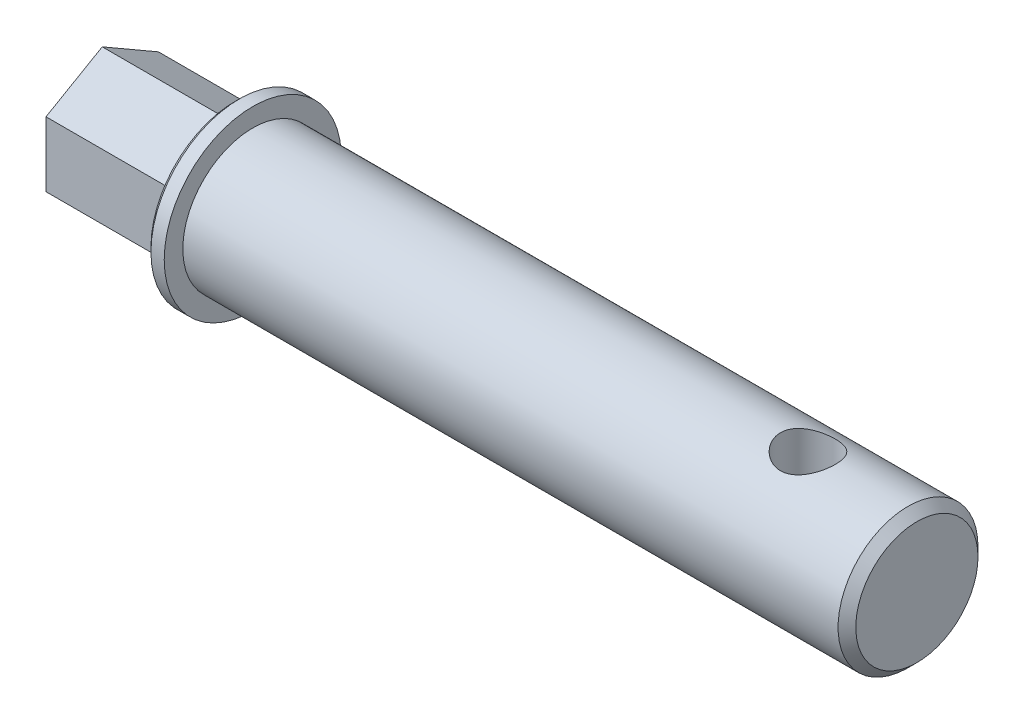
ISO-10303-21;
HEADER;
FILE_DESCRIPTION(('STEP AP214'),'2;1');
FILE_NAME('part.step','',(''),(''),'','','');
FILE_SCHEMA(('AUTOMOTIVE_DESIGN { 1 0 10303 214 1 1 1 1 }'));
ENDSEC;
DATA;
#1=APPLICATION_CONTEXT('core data for automotive mechanical design processes');
#2=APPLICATION_PROTOCOL_DEFINITION('international standard','automotive_design',2000,#1);
#3=PRODUCT_CONTEXT('',#1,'mechanical');
#4=PRODUCT('Part','Part','',(#3));
#5=PRODUCT_RELATED_PRODUCT_CATEGORY('part','',(#4));
#6=PRODUCT_DEFINITION_FORMATION('','',#4);
#7=PRODUCT_DEFINITION_CONTEXT('part definition',#1,'design');
#8=PRODUCT_DEFINITION('design','',#6,#7);
#9=PRODUCT_DEFINITION_SHAPE('','',#8);
#10=(LENGTH_UNIT() NAMED_UNIT(*) SI_UNIT(.MILLI.,.METRE.));
#11=(NAMED_UNIT(*) PLANE_ANGLE_UNIT() SI_UNIT($,.RADIAN.));
#12=(NAMED_UNIT(*) SI_UNIT($,.STERADIAN.) SOLID_ANGLE_UNIT());
#13=UNCERTAINTY_MEASURE_WITH_UNIT(LENGTH_MEASURE(1.E-05),#10,'distance_accuracy_value','');
#14=(GEOMETRIC_REPRESENTATION_CONTEXT(3) GLOBAL_UNCERTAINTY_ASSIGNED_CONTEXT((#13)) GLOBAL_UNIT_ASSIGNED_CONTEXT((#10,
#11,#12)) REPRESENTATION_CONTEXT('',''));
#15=CARTESIAN_POINT('',(0.,0.,0.));
#16=DIRECTION('',(0.,0.,1.));
#17=DIRECTION('',(1.,0.,0.));
#18=AXIS2_PLACEMENT_3D('',#15,#16,#17);
#19=CARTESIAN_POINT('',(75.,0.,0.));
#20=DIRECTION('',(-1.,0.,0.));
#21=DIRECTION('',(0.,0.,1.));
#22=AXIS2_PLACEMENT_3D('',#19,#20,#21);
#23=CYLINDRICAL_SURFACE('',#22,7.9);
#24=CARTESIAN_POINT('',(74.,0.,0.));
#25=DIRECTION('',(1.,0.,0.));
#26=DIRECTION('',(0.,0.,-1.));
#27=AXIS2_PLACEMENT_3D('',#24,#25,#26);
#28=CIRCLE('',#27,7.9);
#29=CARTESIAN_POINT('',(74.,0.,-7.9));
#30=VERTEX_POINT('',#29);
#31=EDGE_CURVE('E11',#30,#30,#28,.F.);
#32=ORIENTED_EDGE('',*,*,#31,.T.);
#33=EDGE_LOOP('',(#32));
#34=FACE_BOUND('',#33,.T.);
#35=CARTESIAN_POINT('',(62.7,-7.26636084983398,3.1));
#36=CARTESIAN_POINT('',(62.8663346158653,-7.26636710949805,3.09999351847052));
#37=CARTESIAN_POINT('',(63.032955051347,-7.27215151188824,3.08653260810271));
#38=CARTESIAN_POINT('',(63.3614156667575,-7.29454929489087,3.03320818850061));
#39=CARTESIAN_POINT('',(63.5232421978606,-7.3111909710545,2.993275686265));
#40=CARTESIAN_POINT('',(63.836837463668,-7.35311644879813,2.88873826778125));
#41=CARTESIAN_POINT('',(63.988640815679,-7.37836842341094,2.82422411303483));
#42=CARTESIAN_POINT('',(64.279229699383,-7.43462186683479,2.67262213711968));
#43=CARTESIAN_POINT('',(64.4180184258772,-7.46562191902808,2.58553987577835));
#44=CARTESIAN_POINT('',(64.6863577176001,-7.53178988522266,2.38614625265945));
#45=CARTESIAN_POINT('',(64.8151025114832,-7.56708854791226,2.27279336643923));
#46=CARTESIAN_POINT('',(65.0523408001219,-7.63679417086448,2.02627051594454));
#47=CARTESIAN_POINT('',(65.1608273547092,-7.67120082207378,1.8930937882975));
#48=CARTESIAN_POINT('',(65.3584190684678,-7.73680588764178,1.60452776876882));
#49=CARTESIAN_POINT('',(65.446638915474,-7.76783435643637,1.44849015051635));
#50=CARTESIAN_POINT('',(65.5952363077978,-7.82160938152175,1.12235484500191));
#51=CARTESIAN_POINT('',(65.6556247803774,-7.84435918747372,0.9522627068662));
#52=CARTESIAN_POINT('',(65.7439900088521,-7.8780889029301,0.611288894812907));
#53=CARTESIAN_POINT('',(65.7733510058438,-7.88956968563781,0.440816487760325));
#54=CARTESIAN_POINT('',(65.8032782997886,-7.90127416736964,0.0970035923543423));
#55=CARTESIAN_POINT('',(65.8038549176573,-7.9015019012822,-0.0763358456964709));
#56=CARTESIAN_POINT('',(65.7769707233346,-7.89098374274002,-0.410982263764649));
#57=CARTESIAN_POINT('',(65.7510248395394,-7.88083077517019,-0.572432918358051));
#58=CARTESIAN_POINT('',(65.6744000798044,-7.85148454908575,-0.888475888709478));
#59=CARTESIAN_POINT('',(65.6237193950644,-7.83229062943026,-1.04306770199382));
#60=CARTESIAN_POINT('',(65.4984356728259,-7.78638595408502,-1.34376022091284));
#61=CARTESIAN_POINT('',(65.4234864867021,-7.7595671621817,-1.48969952838418));
#62=CARTESIAN_POINT('',(65.2521117557785,-7.70109054775387,-1.76730265121788));
#63=CARTESIAN_POINT('',(65.1556789739854,-7.669431095728,-1.89896163381685));
#64=CARTESIAN_POINT('',(64.9369345031472,-7.60213011382685,-2.15313469104067));
#65=CARTESIAN_POINT('',(64.8133687799584,-7.56636337963099,-2.27453800786142));
#66=CARTESIAN_POINT('',(64.5474682063288,-7.49644610764409,-2.49534358123239));
#67=CARTESIAN_POINT('',(64.4051276940868,-7.46229606162649,-2.59473917672859));
#68=CARTESIAN_POINT('',(64.100934093372,-7.39864628524178,-2.77111583740955));
#69=CARTESIAN_POINT('',(63.9386662882743,-7.36929247480008,-2.84743866932457));
#70=CARTESIAN_POINT('',(63.6021231218695,-7.32026092803281,-2.97123993980027));
#71=CARTESIAN_POINT('',(63.4278552863409,-7.30057718904605,-3.01873627662335));
#72=CARTESIAN_POINT('',(63.0833103877494,-7.27455842500944,-3.08088870825382));
#73=CARTESIAN_POINT('',(62.9134097779068,-7.26750084415873,-3.09732569005301));
#74=CARTESIAN_POINT('',(62.5731685572606,-7.26547874677008,-3.1020697807133));
#75=CARTESIAN_POINT('',(62.4028280861175,-7.27051077392634,-3.09038492934168));
#76=CARTESIAN_POINT('',(62.0761924153556,-7.29136168311245,-3.0408365957478));
#77=CARTESIAN_POINT('',(61.9196352061247,-7.30658412661714,-3.00441907668649));
#78=CARTESIAN_POINT('',(61.61494687702,-7.34537082896778,-2.9082973888063));
#79=CARTESIAN_POINT('',(61.4668175894863,-7.36893689384266,-2.84858817807036));
#80=CARTESIAN_POINT('',(61.1766437294025,-7.4229011344714,-2.70492734752464));
#81=CARTESIAN_POINT('',(61.035073528034,-7.45353322003857,-2.62010812950565));
#82=CARTESIAN_POINT('',(60.7675488559212,-7.51781026296112,-2.42953287787291));
#83=CARTESIAN_POINT('',(60.641600585207,-7.55145640747006,-2.32376857454228));
#84=CARTESIAN_POINT('',(60.3996609386638,-7.62083862099281,-2.08548659754755));
#85=CARTESIAN_POINT('',(60.2849996702752,-7.65655459372233,-1.95160756790944));
#86=CARTESIAN_POINT('',(60.0795789140203,-7.72380524707335,-1.66564707700383));
#87=CARTESIAN_POINT('',(59.9888200959832,-7.75533981050502,-1.51356510580067));
#88=CARTESIAN_POINT('',(59.8342062589481,-7.8107333959728,-1.19519200109595));
#89=CARTESIAN_POINT('',(59.7703154448083,-7.83460262013608,-1.02892012997482));
#90=CARTESIAN_POINT('',(59.6718145968231,-7.87196334688755,-0.68682623808169));
#91=CARTESIAN_POINT('',(59.6371893378757,-7.88546024523873,-0.511009233796522));
#92=CARTESIAN_POINT('',(59.5999603235447,-7.89999893201713,-0.166782109029396));
#93=CARTESIAN_POINT('',(59.5954732868068,-7.90177312742045,0.00139503627098454));
#94=CARTESIAN_POINT('',(59.6137147193285,-7.89462371314277,0.33601696631202));
#95=CARTESIAN_POINT('',(59.6364393329402,-7.8857016190303,0.502461993108073));
#96=CARTESIAN_POINT('',(59.7071186515031,-7.85851915942147,0.824011500662942));
#97=CARTESIAN_POINT('',(59.7543306177467,-7.84053412055966,0.979304350402073));
#98=CARTESIAN_POINT('',(59.8718772878859,-7.79713434870136,1.27974962339402));
#99=CARTESIAN_POINT('',(59.9422163314305,-7.77171822140757,1.42490013729914));
#100=CARTESIAN_POINT('',(60.1074880294908,-7.71458712095708,1.70789189369716));
#101=CARTESIAN_POINT('',(60.2033596569827,-7.68264574398631,1.84513809037887));
#102=CARTESIAN_POINT('',(60.4155485901598,-7.6163358678509,2.10215993043257));
#103=CARTESIAN_POINT('',(60.531873895833,-7.58196642216091,2.22192870424559));
#104=CARTESIAN_POINT('',(60.789797808028,-7.5121619951126,2.44790370354027));
#105=CARTESIAN_POINT('',(60.9324834356141,-7.47678400107563,2.5528908434814));
#106=CARTESIAN_POINT('',(61.2345985047733,-7.41118964250036,2.7375005231295));
#107=CARTESIAN_POINT('',(61.3940301805223,-7.38097396810959,2.81711967263318));
#108=CARTESIAN_POINT('',(61.7108824577639,-7.33185112675661,2.94246477377473));
#109=CARTESIAN_POINT('',(61.8672551846109,-7.31218506218555,2.99054925616674));
#110=CARTESIAN_POINT('',(62.1862638472352,-7.28278017018195,3.06147434223789));
#111=CARTESIAN_POINT('',(62.3488807627946,-7.27301334718375,3.08438615105577));
#112=CARTESIAN_POINT('',(62.5434300569129,-7.26797919196603,3.09620318071312));
#113=CARTESIAN_POINT('',(62.5747206160718,-7.26737334317915,3.09762586595494));
#114=CARTESIAN_POINT('',(62.6373374006321,-7.26656356990444,3.09952491572972));
#115=CARTESIAN_POINT('',(62.6686636281416,-7.26635967055353,3.10000122107847));
#116=CARTESIAN_POINT('',(62.7,-7.26636084983398,3.1));
#117=B_SPLINE_CURVE_WITH_KNOTS('',3,(#35,#36,#37,#38,#39,#40,#41,#42,#43,#44,#45,#46,#47,#48,
#49,#50,#51,#52,#53,#54,#55,#56,#57,#58,#59,#60,#61,#62,#63,#64,#65,#66,#67,#68,#69,#70,#71,#72,
#73,#74,#75,#76,#77,#78,#79,#80,#81,#82,#83,#84,#85,#86,#87,#88,#89,#90,#91,#92,#93,#94,#95,#96,
#97,#98,#99,#100,#101,#102,#103,#104,#105,#106,#107,#108,#109,#110,#111,#112,#113,#114,#115,
#116),.UNSPECIFIED.,.T.,.F.,(4,2,2,2,2,2,2,2,2,2,2,2,2,2,2,2,2,2,2,2,2,2,2,2,2,2,2,2,2,2,2,2,2,
2,2,2,2,2,2,2,4),(0.,0.498874424301251,0.999054205742633,1.49740482089949,1.99563278004858,
2.51870508656057,3.04195626233956,3.58494241162902,4.12771518959492,4.64509354386726,
5.16228638582812,5.65150295746496,6.14075530976999,6.63731841942564,7.13404905561472,
7.66230622600666,8.19072306554443,8.73303688914271,9.27501364673123,9.78484159993364,
10.2945238154402,10.7767158069103,11.2590122357218,11.7604380692871,12.2620622762048,
12.7990899242406,13.336132620046,13.8724575516268,14.4085032936735,14.9107131357066,
15.4128518275076,15.900580708621,16.3884011612398,16.8975012425558,17.4068008914588,
17.94618562104,18.4856424043234,18.9778301982151,19.4686221428479,19.5626009988923,
19.6565857319511),.UNSPECIFIED.);
#118=CARTESIAN_POINT('',(62.7,-7.26636084983398,3.1));
#119=VERTEX_POINT('',#118);
#120=EDGE_CURVE('E111',#119,#119,#117,.T.);
#121=ORIENTED_EDGE('',*,*,#120,.T.);
#122=EDGE_LOOP('',(#121));
#123=FACE_BOUND('',#122,.T.);
#124=CARTESIAN_POINT('',(62.7,7.26636084983398,3.1));
#125=CARTESIAN_POINT('',(62.5336653841347,7.26636710949805,3.09999351847052));
#126=CARTESIAN_POINT('',(62.367044948653,7.27215151188824,3.08653260810271));
#127=CARTESIAN_POINT('',(62.0385843332426,7.29454929489087,3.03320818850061));
#128=CARTESIAN_POINT('',(61.8767578021394,7.3111909710545,2.993275686265));
#129=CARTESIAN_POINT('',(61.563162536332,7.35311644879813,2.88873826778125));
#130=CARTESIAN_POINT('',(61.4113591843211,7.37836842341094,2.82422411303483));
#131=CARTESIAN_POINT('',(61.1207703006171,7.43462186683478,2.67262213711969));
#132=CARTESIAN_POINT('',(60.9819815741229,7.46562191902807,2.58553987577836));
#133=CARTESIAN_POINT('',(60.7136422823999,7.53178988522266,2.38614625265947));
#134=CARTESIAN_POINT('',(60.5848974885168,7.56708854791225,2.27279336643924));
#135=CARTESIAN_POINT('',(60.3476591998781,7.63679417086448,2.02627051594455));
#136=CARTESIAN_POINT('',(60.2391726452908,7.67120082207378,1.89309378829751));
#137=CARTESIAN_POINT('',(60.0415809315322,7.73680588764177,1.60452776876883));
#138=CARTESIAN_POINT('',(59.953361084526,7.76783435643637,1.44849015051636));
#139=CARTESIAN_POINT('',(59.8047636922022,7.82160938152175,1.12235484500192));
#140=CARTESIAN_POINT('',(59.7443752196227,7.84435918747372,0.952262706866213));
#141=CARTESIAN_POINT('',(59.656009991148,7.8780889029301,0.611288894812922));
#142=CARTESIAN_POINT('',(59.6266489941562,7.88956968563781,0.440816487760339));
#143=CARTESIAN_POINT('',(59.5967217002114,7.90127416736964,0.0970035923543558));
#144=CARTESIAN_POINT('',(59.5961450823427,7.9015019012822,-0.0763358456964588));
#145=CARTESIAN_POINT('',(59.6230292766654,7.89098374274002,-0.41098226376464));
#146=CARTESIAN_POINT('',(59.6489751604606,7.88083077517019,-0.572432918358042));
#147=CARTESIAN_POINT('',(59.7255999201956,7.85148454908576,-0.88847588870947));
#148=CARTESIAN_POINT('',(59.7762806049356,7.83229062943026,-1.04306770199381));
#149=CARTESIAN_POINT('',(59.9015643271741,7.78638595408502,-1.34376022091283));
#150=CARTESIAN_POINT('',(59.9765135132979,7.75956716218171,-1.48969952838417));
#151=CARTESIAN_POINT('',(60.1478882442215,7.70109054775387,-1.76730265121787));
#152=CARTESIAN_POINT('',(60.2443210260146,7.669431095728,-1.89896163381683));
#153=CARTESIAN_POINT('',(60.4630654968528,7.60213011382685,-2.15313469104066));
#154=CARTESIAN_POINT('',(60.5866312200416,7.56636337963099,-2.27453800786141));
#155=CARTESIAN_POINT('',(60.8525317936712,7.4964461076441,-2.49534358123239));
#156=CARTESIAN_POINT('',(60.9948723059132,7.4622960616265,-2.59473917672858));
#157=CARTESIAN_POINT('',(61.299065906628,7.39864628524178,-2.77111583740955));
#158=CARTESIAN_POINT('',(61.4613337117257,7.36929247480008,-2.84743866932457));
#159=CARTESIAN_POINT('',(61.7978768781305,7.32026092803281,-2.97123993980027));
#160=CARTESIAN_POINT('',(61.9721447136591,7.30057718904605,-3.01873627662334));
#161=CARTESIAN_POINT('',(62.3166896122506,7.27455842500944,-3.08088870825382));
#162=CARTESIAN_POINT('',(62.4865902220932,7.26750084415873,-3.09732569005301));
#163=CARTESIAN_POINT('',(62.8268314427394,7.26547874677008,-3.1020697807133));
#164=CARTESIAN_POINT('',(62.9971719138825,7.27051077392634,-3.09038492934168));
#165=CARTESIAN_POINT('',(63.3238075846444,7.29136168311245,-3.0408365957478));
#166=CARTESIAN_POINT('',(63.4803647938753,7.30658412661714,-3.00441907668649));
#167=CARTESIAN_POINT('',(63.78505312298,7.34537082896778,-2.9082973888063));
#168=CARTESIAN_POINT('',(63.9331824105137,7.36893689384266,-2.84858817807036));
#169=CARTESIAN_POINT('',(64.2233562705975,7.42290113447139,-2.70492734752464));
#170=CARTESIAN_POINT('',(64.364926471966,7.45353322003857,-2.62010812950566));
#171=CARTESIAN_POINT('',(64.6324511440788,7.51781026296111,-2.42953287787292));
#172=CARTESIAN_POINT('',(64.758399414793,7.55145640747005,-2.32376857454229));
#173=CARTESIAN_POINT('',(65.0003390613362,7.62083862099281,-2.08548659754756));
#174=CARTESIAN_POINT('',(65.1150003297248,7.65655459372233,-1.95160756790946));
#175=CARTESIAN_POINT('',(65.3204210859797,7.72380524707335,-1.66564707700385));
#176=CARTESIAN_POINT('',(65.4111799040168,7.75533981050502,-1.51356510580069));
#177=CARTESIAN_POINT('',(65.5657937410519,7.81073339597279,-1.19519200109597));
#178=CARTESIAN_POINT('',(65.6296845551917,7.83460262013608,-1.02892012997484));
#179=CARTESIAN_POINT('',(65.7281854031769,7.87196334688755,-0.686826238081707));
#180=CARTESIAN_POINT('',(65.7628106621243,7.88546024523873,-0.511009233796538));
#181=CARTESIAN_POINT('',(65.8000396764553,7.89999893201713,-0.166782109029411));
#182=CARTESIAN_POINT('',(65.8045267131932,7.90177312742045,0.00139503627097004));
#183=CARTESIAN_POINT('',(65.7862852806715,7.89462371314277,0.336016966312006));
#184=CARTESIAN_POINT('',(65.7635606670597,7.88570161903031,0.50246199310806));
#185=CARTESIAN_POINT('',(65.6928813484969,7.85851915942147,0.82401150066293));
#186=CARTESIAN_POINT('',(65.6456693822533,7.84053412055966,0.979304350402062));
#187=CARTESIAN_POINT('',(65.5281227121142,7.79713434870136,1.27974962339401));
#188=CARTESIAN_POINT('',(65.4577836685695,7.77171822140757,1.42490013729913));
#189=CARTESIAN_POINT('',(65.2925119705092,7.71458712095708,1.70789189369714));
#190=CARTESIAN_POINT('',(65.1966403430173,7.68264574398632,1.84513809037885));
#191=CARTESIAN_POINT('',(64.9844514098402,7.6163358678509,2.10215993043255));
#192=CARTESIAN_POINT('',(64.868126104167,7.58196642216091,2.22192870424558));
#193=CARTESIAN_POINT('',(64.610202191972,7.5121619951126,2.44790370354027));
#194=CARTESIAN_POINT('',(64.4675165643859,7.47678400107563,2.5528908434814));
#195=CARTESIAN_POINT('',(64.1654014952267,7.41118964250036,2.7375005231295));
#196=CARTESIAN_POINT('',(64.0059698194777,7.38097396810959,2.81711967263318));
#197=CARTESIAN_POINT('',(63.6891175422361,7.33185112675661,2.94246477377473));
#198=CARTESIAN_POINT('',(63.5327448153892,7.31218506218555,2.99054925616674));
#199=CARTESIAN_POINT('',(63.2137361527648,7.28278017018195,3.06147434223789));
#200=CARTESIAN_POINT('',(63.0511192372055,7.27301334718376,3.08438615105577));
#201=CARTESIAN_POINT('',(62.8565699430871,7.26797919196603,3.09620318071312));
#202=CARTESIAN_POINT('',(62.8252793839282,7.26737334317915,3.09762586595494));
#203=CARTESIAN_POINT('',(62.7626625993679,7.26656356990444,3.09952491572972));
#204=CARTESIAN_POINT('',(62.7313363718584,7.26635967055353,3.10000122107847));
#205=CARTESIAN_POINT('',(62.7,7.26636084983398,3.1));
#206=B_SPLINE_CURVE_WITH_KNOTS('',3,(#124,#125,#126,#127,#128,#129,#130,#131,#132,#133,#134,
#135,#136,#137,#138,#139,#140,#141,#142,#143,#144,#145,#146,#147,#148,#149,#150,#151,#152,#153,
#154,#155,#156,#157,#158,#159,#160,#161,#162,#163,#164,#165,#166,#167,#168,#169,#170,#171,#172,
#173,#174,#175,#176,#177,#178,#179,#180,#181,#182,#183,#184,#185,#186,#187,#188,#189,#190,#191,
#192,#193,#194,#195,#196,#197,#198,#199,#200,#201,#202,#203,#204,#205),.UNSPECIFIED.,.T.,.F.,(4,
2,2,2,2,2,2,2,2,2,2,2,2,2,2,2,2,2,2,2,2,2,2,2,2,2,2,2,2,2,2,2,2,2,2,2,2,2,2,2,4),(0.,
0.498874424301244,0.999054205742626,1.49740482089948,1.99563278004855,2.51870508656055,
3.04195626233955,3.58494241162901,4.1277151895949,4.64509354386725,5.16228638582811,
5.65150295746495,6.14075530976998,6.63731841942563,7.13404905561471,7.66230622600664,
8.19072306554442,8.7330368891427,9.27501364673122,9.78484159993364,10.2945238154401,
10.7767158069103,11.2590122357218,11.7604380692871,12.2620622762048,12.7990899242406,
13.336132620046,13.8724575516268,14.4085032936735,14.9107131357066,15.4128518275076,
15.9005807086209,16.3884011612398,16.8975012425558,17.4068008914588,17.9461856210401,
18.4856424043234,18.977830198215,19.4686221428478,19.5626009988923,19.6565857319511),.UNSPECIFIED.);
#207=CARTESIAN_POINT('',(62.7,7.26636084983398,3.1));
#208=VERTEX_POINT('',#207);
#209=EDGE_CURVE('E168',#208,#208,#206,.T.);
#210=ORIENTED_EDGE('',*,*,#209,.T.);
#211=EDGE_LOOP('',(#210));
#212=FACE_BOUND('',#211,.T.);
#213=CARTESIAN_POINT('',(0.,0.,0.));
#214=DIRECTION('',(1.,0.,0.));
#215=DIRECTION('',(0.,0.,-1.));
#216=AXIS2_PLACEMENT_3D('',#213,#214,#215);
#217=CIRCLE('',#216,7.9);
#218=CARTESIAN_POINT('',(0.,0.,-7.9));
#219=VERTEX_POINT('',#218);
#220=EDGE_CURVE('E159',#219,#219,#217,.T.);
#221=ORIENTED_EDGE('',*,*,#220,.T.);
#222=EDGE_LOOP('',(#221));
#223=FACE_BOUND('',#222,.T.);
#224=ADVANCED_FACE('F43',(#34,#123,#212,#223),#23,.T.);
#225=CARTESIAN_POINT('',(75.,0.,0.));
#226=DIRECTION('',(1.,0.,0.));
#227=DIRECTION('',(0.,0.,-1.));
#228=AXIS2_PLACEMENT_3D('',#225,#226,#227);
#229=PLANE('',#228);
#230=CARTESIAN_POINT('',(75.,0.,0.));
#231=DIRECTION('',(1.,0.,0.));
#232=DIRECTION('',(0.,0.,-1.));
#233=AXIS2_PLACEMENT_3D('',#230,#231,#232);
#234=CIRCLE('',#233,6.9);
#235=CARTESIAN_POINT('',(75.,0.,-6.9));
#236=VERTEX_POINT('',#235);
#237=EDGE_CURVE('E52',#236,#236,#234,.T.);
#238=ORIENTED_EDGE('',*,*,#237,.T.);
#239=EDGE_LOOP('',(#238));
#240=FACE_BOUND('',#239,.T.);
#241=ADVANCED_FACE('F227',(#240),#229,.T.);
#242=CARTESIAN_POINT('',(-2.,0.,0.));
#243=DIRECTION('',(1.,0.,0.));
#244=DIRECTION('',(0.,0.,-1.));
#245=AXIS2_PLACEMENT_3D('',#242,#243,#244);
#246=CYLINDRICAL_SURFACE('',#245,10.);
#247=CARTESIAN_POINT('',(-1.49999999999999,0.,0.));
#248=DIRECTION('',(-1.,0.,0.));
#249=DIRECTION('',(0.,0.,1.));
#250=AXIS2_PLACEMENT_3D('',#247,#248,#249);
#251=CIRCLE('',#250,10.);
#252=CARTESIAN_POINT('',(-1.49999999999999,0.,10.));
#253=VERTEX_POINT('',#252);
#254=EDGE_CURVE('E165',#253,#253,#251,.F.);
#255=ORIENTED_EDGE('',*,*,#254,.T.);
#256=EDGE_LOOP('',(#255));
#257=FACE_BOUND('',#256,.T.);
#258=CARTESIAN_POINT('',(0.,0.,0.));
#259=DIRECTION('',(-1.,0.,0.));
#260=DIRECTION('',(0.,0.,1.));
#261=AXIS2_PLACEMENT_3D('',#258,#259,#260);
#262=CIRCLE('',#261,10.);
#263=CARTESIAN_POINT('',(0.,0.,10.));
#264=VERTEX_POINT('',#263);
#265=EDGE_CURVE('E156',#264,#264,#262,.T.);
#266=ORIENTED_EDGE('',*,*,#265,.T.);
#267=EDGE_LOOP('',(#266));
#268=FACE_BOUND('',#267,.T.);
#269=ADVANCED_FACE('F221',(#257,#268),#246,.T.);
#270=CARTESIAN_POINT('',(-2.,0.,0.));
#271=DIRECTION('',(-1.,0.,0.));
#272=DIRECTION('',(0.,0.,1.));
#273=AXIS2_PLACEMENT_3D('',#270,#271,#272);
#274=PLANE('',#273);
#275=CARTESIAN_POINT('',(-2.,0.,0.));
#276=DIRECTION('',(-1.,0.,0.));
#277=DIRECTION('',(0.,0.,1.));
#278=AXIS2_PLACEMENT_3D('',#275,#276,#277);
#279=CIRCLE('',#278,9.49999999999999);
#280=CARTESIAN_POINT('',(-2.,0.,9.49999999999999));
#281=VERTEX_POINT('',#280);
#282=EDGE_CURVE('E162',#281,#281,#279,.T.);
#283=ORIENTED_EDGE('',*,*,#282,.T.);
#284=EDGE_LOOP('',(#283));
#285=FACE_BOUND('',#284,.T.);
#286=DIRECTION('',(0.,1.,0.));
#287=VECTOR('',#286,1.);
#288=CARTESIAN_POINT('',(-2.,-3.6661742093541,6.35000000000002));
#289=LINE('',#288,#287);
#290=CARTESIAN_POINT('',(-2.,-3.6661742093541,6.35000000000002));
#291=VERTEX_POINT('',#290);
#292=CARTESIAN_POINT('',(-2.,3.66617420935415,6.34999999999999));
#293=VERTEX_POINT('',#292);
#294=EDGE_CURVE('E59',#291,#293,#289,.T.);
#295=ORIENTED_EDGE('',*,*,#294,.F.);
#296=DIRECTION('',(0.,0.500000000000004,0.866025403784437));
#297=VECTOR('',#296,1.);
#298=CARTESIAN_POINT('',(-2.,-7.33234841870825,0.));
#299=LINE('',#298,#297);
#300=CARTESIAN_POINT('',(-2.,-7.33234841870825,0.));
#301=VERTEX_POINT('',#300);
#302=EDGE_CURVE('E63',#301,#291,#299,.T.);
#303=ORIENTED_EDGE('',*,*,#302,.F.);
#304=DIRECTION('',(0.,-0.499999999999996,0.866025403784441));
#305=VECTOR('',#304,1.);
#306=CARTESIAN_POINT('',(-2.,-3.66617420935416,-6.34999999999998));
#307=LINE('',#306,#305);
#308=CARTESIAN_POINT('',(-2.,-3.66617420935416,-6.34999999999998));
#309=VERTEX_POINT('',#308);
#310=EDGE_CURVE('E136',#309,#301,#307,.T.);
#311=ORIENTED_EDGE('',*,*,#310,.F.);
#312=DIRECTION('',(0.,-1.,0.));
#313=VECTOR('',#312,1.);
#314=CARTESIAN_POINT('',(-2.,3.66617420935409,-6.35000000000002));
#315=LINE('',#314,#313);
#316=CARTESIAN_POINT('',(-2.,3.66617420935409,-6.35000000000002));
#317=VERTEX_POINT('',#316);
#318=EDGE_CURVE('E133',#317,#309,#315,.T.);
#319=ORIENTED_EDGE('',*,*,#318,.F.);
#320=DIRECTION('',(0.,-0.500000000000005,-0.866025403784436));
#321=VECTOR('',#320,1.);
#322=CARTESIAN_POINT('',(-2.,7.33234841870825,0.));
#323=LINE('',#322,#321);
#324=CARTESIAN_POINT('',(-2.,7.33234841870825,0.));
#325=VERTEX_POINT('',#324);
#326=EDGE_CURVE('E130',#325,#317,#323,.T.);
#327=ORIENTED_EDGE('',*,*,#326,.F.);
#328=DIRECTION('',(0.,0.499999999999997,-0.866025403784441));
#329=VECTOR('',#328,1.);
#330=CARTESIAN_POINT('',(-2.,3.66617420935415,6.34999999999999));
#331=LINE('',#330,#329);
#332=EDGE_CURVE('E108',#293,#325,#331,.T.);
#333=ORIENTED_EDGE('',*,*,#332,.F.);
#334=EDGE_LOOP('',(#295,#303,#311,#319,#327,#333));
#335=FACE_BOUND('',#334,.T.);
#336=ADVANCED_FACE('F218',(#285,#335),#274,.T.);
#337=CARTESIAN_POINT('',(0.,0.,0.));
#338=DIRECTION('',(-1.,0.,0.));
#339=DIRECTION('',(0.,0.,1.));
#340=AXIS2_PLACEMENT_3D('',#337,#338,#339);
#341=PLANE('',#340);
#342=ORIENTED_EDGE('',*,*,#220,.F.);
#343=EDGE_LOOP('',(#342));
#344=FACE_BOUND('',#343,.T.);
#345=ORIENTED_EDGE('',*,*,#265,.F.);
#346=EDGE_LOOP('',(#345));
#347=FACE_BOUND('',#346,.T.);
#348=ADVANCED_FACE('F216',(#344,#347),#341,.F.);
#349=CARTESIAN_POINT('',(-17.,-3.6661742093541,6.35000000000002));
#350=DIRECTION('',(0.,0.,-1.));
#351=DIRECTION('',(0.,1.,0.));
#352=AXIS2_PLACEMENT_3D('',#349,#350,#351);
#353=PLANE('',#352);
#354=ORIENTED_EDGE('',*,*,#294,.T.);
#355=DIRECTION('',(1.,0.,0.));
#356=VECTOR('',#355,1.);
#357=CARTESIAN_POINT('',(-17.,3.66617420935415,6.34999999999999));
#358=LINE('',#357,#356);
#359=CARTESIAN_POINT('',(-17.,3.66617420935415,6.34999999999999));
#360=VERTEX_POINT('',#359);
#361=EDGE_CURVE('E153',#360,#293,#358,.T.);
#362=ORIENTED_EDGE('',*,*,#361,.F.);
#363=DIRECTION('',(0.,1.,0.));
#364=VECTOR('',#363,1.);
#365=CARTESIAN_POINT('',(-17.,-3.6661742093541,6.35000000000002));
#366=LINE('',#365,#364);
#367=CARTESIAN_POINT('',(-17.,-3.6661742093541,6.35000000000002));
#368=VERTEX_POINT('',#367);
#369=EDGE_CURVE('E114',#368,#360,#366,.T.);
#370=ORIENTED_EDGE('',*,*,#369,.F.);
#371=DIRECTION('',(1.,0.,0.));
#372=VECTOR('',#371,1.);
#373=CARTESIAN_POINT('',(-17.,-3.6661742093541,6.35000000000002));
#374=LINE('',#373,#372);
#375=EDGE_CURVE('E126',#368,#291,#374,.T.);
#376=ORIENTED_EDGE('',*,*,#375,.T.);
#377=EDGE_LOOP('',(#354,#362,#370,#376));
#378=FACE_BOUND('',#377,.T.);
#379=ADVANCED_FACE('F212',(#378),#353,.F.);
#380=CARTESIAN_POINT('',(-17.,3.66617420935415,6.34999999999999));
#381=DIRECTION('',(0.,-0.866025403784441,-0.499999999999996));
#382=DIRECTION('',(0.,0.499999999999997,-0.866025403784441));
#383=AXIS2_PLACEMENT_3D('',#380,#381,#382);
#384=PLANE('',#383);
#385=ORIENTED_EDGE('',*,*,#332,.T.);
#386=DIRECTION('',(1.,0.,0.));
#387=VECTOR('',#386,1.);
#388=CARTESIAN_POINT('',(-17.,7.33234841870825,0.));
#389=LINE('',#388,#387);
#390=CARTESIAN_POINT('',(-17.,7.33234841870825,0.));
#391=VERTEX_POINT('',#390);
#392=EDGE_CURVE('E150',#391,#325,#389,.T.);
#393=ORIENTED_EDGE('',*,*,#392,.F.);
#394=DIRECTION('',(0.,0.499999999999997,-0.866025403784441));
#395=VECTOR('',#394,1.);
#396=CARTESIAN_POINT('',(-17.,3.66617420935415,6.34999999999999));
#397=LINE('',#396,#395);
#398=EDGE_CURVE('E117',#360,#391,#397,.T.);
#399=ORIENTED_EDGE('',*,*,#398,.F.);
#400=ORIENTED_EDGE('',*,*,#361,.T.);
#401=EDGE_LOOP('',(#385,#393,#399,#400));
#402=FACE_BOUND('',#401,.T.);
#403=ADVANCED_FACE('F208',(#402),#384,.F.);
#404=CARTESIAN_POINT('',(-17.,7.33234841870825,0.));
#405=DIRECTION('',(0.,-0.866025403784436,0.500000000000005));
#406=DIRECTION('',(0.,-0.500000000000005,-0.866025403784436));
#407=AXIS2_PLACEMENT_3D('',#404,#405,#406);
#408=PLANE('',#407);
#409=ORIENTED_EDGE('',*,*,#326,.T.);
#410=DIRECTION('',(1.,0.,0.));
#411=VECTOR('',#410,1.);
#412=CARTESIAN_POINT('',(-17.,3.66617420935409,-6.35000000000002));
#413=LINE('',#412,#411);
#414=CARTESIAN_POINT('',(-17.,3.66617420935409,-6.35000000000002));
#415=VERTEX_POINT('',#414);
#416=EDGE_CURVE('E147',#415,#317,#413,.T.);
#417=ORIENTED_EDGE('',*,*,#416,.F.);
#418=DIRECTION('',(0.,-0.500000000000005,-0.866025403784436));
#419=VECTOR('',#418,1.);
#420=CARTESIAN_POINT('',(-17.,7.33234841870825,0.));
#421=LINE('',#420,#419);
#422=EDGE_CURVE('E119',#391,#415,#421,.T.);
#423=ORIENTED_EDGE('',*,*,#422,.F.);
#424=ORIENTED_EDGE('',*,*,#392,.T.);
#425=EDGE_LOOP('',(#409,#417,#423,#424));
#426=FACE_BOUND('',#425,.T.);
#427=ADVANCED_FACE('F204',(#426),#408,.F.);
#428=CARTESIAN_POINT('',(-17.,3.66617420935409,-6.35000000000002));
#429=DIRECTION('',(0.,0.,1.));
#430=DIRECTION('',(0.,-1.,0.));
#431=AXIS2_PLACEMENT_3D('',#428,#429,#430);
#432=PLANE('',#431);
#433=ORIENTED_EDGE('',*,*,#318,.T.);
#434=DIRECTION('',(1.,0.,0.));
#435=VECTOR('',#434,1.);
#436=CARTESIAN_POINT('',(-17.,-3.66617420935416,-6.34999999999998));
#437=LINE('',#436,#435);
#438=CARTESIAN_POINT('',(-17.,-3.66617420935416,-6.34999999999998));
#439=VERTEX_POINT('',#438);
#440=EDGE_CURVE('E144',#439,#309,#437,.T.);
#441=ORIENTED_EDGE('',*,*,#440,.F.);
#442=DIRECTION('',(0.,-1.,0.));
#443=VECTOR('',#442,1.);
#444=CARTESIAN_POINT('',(-17.,3.66617420935409,-6.35000000000002));
#445=LINE('',#444,#443);
#446=EDGE_CURVE('E121',#415,#439,#445,.T.);
#447=ORIENTED_EDGE('',*,*,#446,.F.);
#448=ORIENTED_EDGE('',*,*,#416,.T.);
#449=EDGE_LOOP('',(#433,#441,#447,#448));
#450=FACE_BOUND('',#449,.T.);
#451=ADVANCED_FACE('F200',(#450),#432,.F.);
#452=CARTESIAN_POINT('',(-17.,-3.66617420935416,-6.34999999999998));
#453=DIRECTION('',(0.,0.866025403784441,0.499999999999996));
#454=DIRECTION('',(0.,-0.499999999999996,0.866025403784441));
#455=AXIS2_PLACEMENT_3D('',#452,#453,#454);
#456=PLANE('',#455);
#457=ORIENTED_EDGE('',*,*,#310,.T.);
#458=DIRECTION('',(1.,0.,0.));
#459=VECTOR('',#458,1.);
#460=CARTESIAN_POINT('',(-17.,-7.33234841870825,0.));
#461=LINE('',#460,#459);
#462=CARTESIAN_POINT('',(-17.,-7.33234841870825,0.));
#463=VERTEX_POINT('',#462);
#464=EDGE_CURVE('E141',#463,#301,#461,.T.);
#465=ORIENTED_EDGE('',*,*,#464,.F.);
#466=DIRECTION('',(0.,-0.499999999999996,0.866025403784441));
#467=VECTOR('',#466,1.);
#468=CARTESIAN_POINT('',(-17.,-3.66617420935416,-6.34999999999998));
#469=LINE('',#468,#467);
#470=EDGE_CURVE('E123',#439,#463,#469,.T.);
#471=ORIENTED_EDGE('',*,*,#470,.F.);
#472=ORIENTED_EDGE('',*,*,#440,.T.);
#473=EDGE_LOOP('',(#457,#465,#471,#472));
#474=FACE_BOUND('',#473,.T.);
#475=ADVANCED_FACE('F196',(#474),#456,.F.);
#476=CARTESIAN_POINT('',(-17.,-7.33234841870825,0.));
#477=DIRECTION('',(0.,0.866025403784437,-0.500000000000003));
#478=DIRECTION('',(0.,0.500000000000004,0.866025403784437));
#479=AXIS2_PLACEMENT_3D('',#476,#477,#478);
#480=PLANE('',#479);
#481=ORIENTED_EDGE('',*,*,#302,.T.);
#482=ORIENTED_EDGE('',*,*,#375,.F.);
#483=DIRECTION('',(0.,0.500000000000004,0.866025403784437));
#484=VECTOR('',#483,1.);
#485=CARTESIAN_POINT('',(-17.,-7.33234841870825,0.));
#486=LINE('',#485,#484);
#487=EDGE_CURVE('E125',#463,#368,#486,.T.);
#488=ORIENTED_EDGE('',*,*,#487,.F.);
#489=ORIENTED_EDGE('',*,*,#464,.T.);
#490=EDGE_LOOP('',(#481,#482,#488,#489));
#491=FACE_BOUND('',#490,.T.);
#492=ADVANCED_FACE('F192',(#491),#480,.F.);
#493=CARTESIAN_POINT('',(-17.,0.,0.));
#494=DIRECTION('',(-1.,0.,0.));
#495=DIRECTION('',(0.,0.,1.));
#496=AXIS2_PLACEMENT_3D('',#493,#494,#495);
#497=PLANE('',#496);
#498=CARTESIAN_POINT('',(-17.,0.,0.));
#499=DIRECTION('',(-1.,0.,0.));
#500=DIRECTION('',(0.,0.,1.));
#501=AXIS2_PLACEMENT_3D('',#498,#499,#500);
#502=CIRCLE('',#501,2.1);
#503=CARTESIAN_POINT('',(-17.,0.,2.1));
#504=VERTEX_POINT('',#503);
#505=EDGE_CURVE('E106',#504,#504,#502,.T.);
#506=ORIENTED_EDGE('',*,*,#505,.F.);
#507=EDGE_LOOP('',(#506));
#508=FACE_BOUND('',#507,.T.);
#509=ORIENTED_EDGE('',*,*,#369,.T.);
#510=ORIENTED_EDGE('',*,*,#398,.T.);
#511=ORIENTED_EDGE('',*,*,#422,.T.);
#512=ORIENTED_EDGE('',*,*,#446,.T.);
#513=ORIENTED_EDGE('',*,*,#470,.T.);
#514=ORIENTED_EDGE('',*,*,#487,.T.);
#515=EDGE_LOOP('',(#509,#510,#511,#512,#513,#514));
#516=FACE_BOUND('',#515,.T.);
#517=ADVANCED_FACE('F189',(#508,#516),#497,.T.);
#518=CARTESIAN_POINT('',(-2.,0.,0.));
#519=DIRECTION('',(1.,0.,0.));
#520=DIRECTION('',(0.,0.,-1.));
#521=AXIS2_PLACEMENT_3D('',#518,#519,#520);
#522=CONICAL_SURFACE('',#521,9.49999999999999,0.785398163397441);
#523=ORIENTED_EDGE('',*,*,#254,.F.);
#524=EDGE_LOOP('',(#523));
#525=FACE_BOUND('',#524,.T.);
#526=ORIENTED_EDGE('',*,*,#282,.F.);
#527=EDGE_LOOP('',(#526));
#528=FACE_BOUND('',#527,.T.);
#529=ADVANCED_FACE('F100',(#525,#528),#522,.T.);
#530=CARTESIAN_POINT('',(-4.6,0.,0.));
#531=DIRECTION('',(-1.,0.,0.));
#532=DIRECTION('',(0.,0.,1.));
#533=AXIS2_PLACEMENT_3D('',#530,#531,#532);
#534=CONICAL_SURFACE('',#533,2.1,1.02974425867665);
#535=CARTESIAN_POINT('',(-3.33819270004212,0.,0.));
#536=VERTEX_POINT('',#535);
#537=VERTEX_LOOP('',#536);
#538=FACE_BOUND('',#537,.T.);
#539=CARTESIAN_POINT('',(-4.6,0.,0.));
#540=DIRECTION('',(-1.,0.,0.));
#541=DIRECTION('',(0.,0.,1.));
#542=AXIS2_PLACEMENT_3D('',#539,#540,#541);
#543=CIRCLE('',#542,2.1);
#544=CARTESIAN_POINT('',(-4.6,0.,2.1));
#545=VERTEX_POINT('',#544);
#546=EDGE_CURVE('E104',#545,#545,#543,.T.);
#547=ORIENTED_EDGE('',*,*,#546,.T.);
#548=EDGE_LOOP('',(#547));
#549=FACE_BOUND('',#548,.T.);
#550=ADVANCED_FACE('F96',(#538,#549),#534,.F.);
#551=CARTESIAN_POINT('',(-17.,0.,0.));
#552=DIRECTION('',(-1.,0.,0.));
#553=DIRECTION('',(0.,0.,1.));
#554=AXIS2_PLACEMENT_3D('',#551,#552,#553);
#555=CYLINDRICAL_SURFACE('',#554,2.1);
#556=ORIENTED_EDGE('',*,*,#546,.F.);
#557=EDGE_LOOP('',(#556));
#558=FACE_BOUND('',#557,.T.);
#559=ORIENTED_EDGE('',*,*,#505,.T.);
#560=EDGE_LOOP('',(#559));
#561=FACE_BOUND('',#560,.T.);
#562=ADVANCED_FACE('F99',(#558,#561),#555,.F.);
#563=CARTESIAN_POINT('',(62.7,-10.,0.));
#564=DIRECTION('',(0.,1.,0.));
#565=DIRECTION('',(0.,0.,1.));
#566=AXIS2_PLACEMENT_3D('',#563,#564,#565);
#567=CYLINDRICAL_SURFACE('',#566,3.1);
#568=ORIENTED_EDGE('',*,*,#209,.F.);
#569=EDGE_LOOP('',(#568));
#570=FACE_BOUND('',#569,.T.);
#571=ORIENTED_EDGE('',*,*,#120,.F.);
#572=EDGE_LOOP('',(#571));
#573=FACE_BOUND('',#572,.T.);
#574=ADVANCED_FACE('F181',(#570,#573),#567,.F.);
#575=CARTESIAN_POINT('',(75.,0.,0.));
#576=DIRECTION('',(-1.,0.,0.));
#577=DIRECTION('',(0.,0.,1.));
#578=AXIS2_PLACEMENT_3D('',#575,#576,#577);
#579=CONICAL_SURFACE('',#578,6.9,0.785398163397439);
#580=ORIENTED_EDGE('',*,*,#31,.F.);
#581=EDGE_LOOP('',(#580));
#582=FACE_BOUND('',#581,.T.);
#583=ORIENTED_EDGE('',*,*,#237,.F.);
#584=EDGE_LOOP('',(#583));
#585=FACE_BOUND('',#584,.T.);
#586=ADVANCED_FACE('F46',(#582,#585),#579,.T.);
#587=CLOSED_SHELL('',(#224,#241,#269,#336,#348,#379,#403,#427,#451,#475,#492,#517,#529,#550,
#562,#574,#586));
#588=MANIFOLD_SOLID_BREP('B2',#587);
#589=ADVANCED_BREP_SHAPE_REPRESENTATION('',(#18,#588),#14);
#590=SHAPE_DEFINITION_REPRESENTATION(#9,#589);
ENDSEC;
END-ISO-10303-21;
